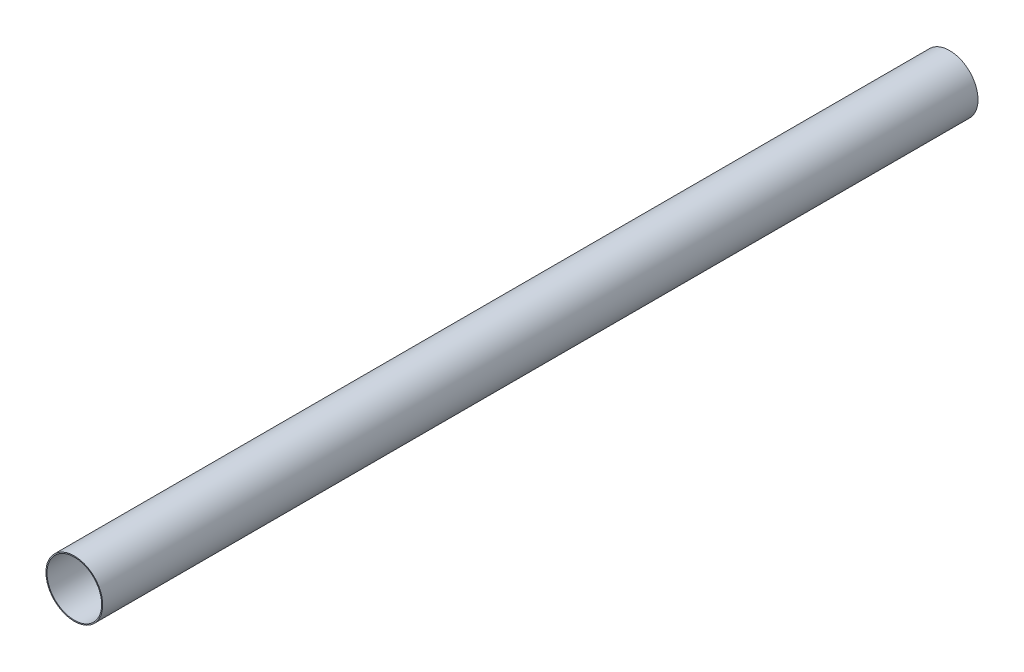
ISO-10303-21;
HEADER;
FILE_DESCRIPTION(('STEP AP214'),'2;1');
FILE_NAME('part.step','',(''),(''),'','','');
FILE_SCHEMA(('AUTOMOTIVE_DESIGN { 1 0 10303 214 1 1 1 1 }'));
ENDSEC;
DATA;
#1=APPLICATION_CONTEXT('core data for automotive mechanical design processes');
#2=APPLICATION_PROTOCOL_DEFINITION('international standard','automotive_design',2000,#1);
#3=PRODUCT_CONTEXT('',#1,'mechanical');
#4=PRODUCT('Part','Part','',(#3));
#5=PRODUCT_RELATED_PRODUCT_CATEGORY('part','',(#4));
#6=PRODUCT_DEFINITION_FORMATION('','',#4);
#7=PRODUCT_DEFINITION_CONTEXT('part definition',#1,'design');
#8=PRODUCT_DEFINITION('design','',#6,#7);
#9=PRODUCT_DEFINITION_SHAPE('','',#8);
#10=(LENGTH_UNIT() NAMED_UNIT(*) SI_UNIT(.MILLI.,.METRE.));
#11=(NAMED_UNIT(*) PLANE_ANGLE_UNIT() SI_UNIT($,.RADIAN.));
#12=(NAMED_UNIT(*) SI_UNIT($,.STERADIAN.) SOLID_ANGLE_UNIT());
#13=UNCERTAINTY_MEASURE_WITH_UNIT(LENGTH_MEASURE(1.E-05),#10,'distance_accuracy_value','');
#14=(GEOMETRIC_REPRESENTATION_CONTEXT(3) GLOBAL_UNCERTAINTY_ASSIGNED_CONTEXT((#13)) GLOBAL_UNIT_ASSIGNED_CONTEXT((#10,
#11,#12)) REPRESENTATION_CONTEXT('',''));
#15=CARTESIAN_POINT('',(0.,0.,0.));
#16=DIRECTION('',(0.,0.,1.));
#17=DIRECTION('',(1.,0.,0.));
#18=AXIS2_PLACEMENT_3D('',#15,#16,#17);
#19=CARTESIAN_POINT('',(0.,0.,5486.4));
#20=DIRECTION('',(0.,0.,1.));
#21=DIRECTION('',(1.,0.,0.));
#22=AXIS2_PLACEMENT_3D('',#19,#20,#21);
#23=PLANE('',#22);
#24=CARTESIAN_POINT('',(0.,0.,5486.4));
#25=DIRECTION('',(0.,0.,1.));
#26=DIRECTION('',(1.,0.,0.));
#27=AXIS2_PLACEMENT_3D('',#24,#25,#26);
#28=CIRCLE('',#27,177.8);
#29=CARTESIAN_POINT('',(177.8,0.,5486.4));
#30=VERTEX_POINT('',#29);
#31=EDGE_CURVE('E10',#30,#30,#28,.T.);
#32=ORIENTED_EDGE('',*,*,#31,.T.);
#33=EDGE_LOOP('',(#32));
#34=FACE_BOUND('',#33,.T.);
#35=CARTESIAN_POINT('',(0.,0.,5486.4));
#36=DIRECTION('',(0.,0.,1.));
#37=DIRECTION('',(1.,0.,0.));
#38=AXIS2_PLACEMENT_3D('',#35,#36,#37);
#39=CIRCLE('',#38,171.45);
#40=CARTESIAN_POINT('',(171.45,0.,5486.4));
#41=VERTEX_POINT('',#40);
#42=EDGE_CURVE('E39',#41,#41,#39,.T.);
#43=ORIENTED_EDGE('',*,*,#42,.F.);
#44=EDGE_LOOP('',(#43));
#45=FACE_BOUND('',#44,.T.);
#46=ADVANCED_FACE('F28',(#34,#45),#23,.T.);
#47=CARTESIAN_POINT('',(0.,0.,0.));
#48=DIRECTION('',(0.,0.,1.));
#49=DIRECTION('',(1.,0.,0.));
#50=AXIS2_PLACEMENT_3D('',#47,#48,#49);
#51=PLANE('',#50);
#52=CARTESIAN_POINT('',(0.,0.,0.));
#53=DIRECTION('',(0.,0.,1.));
#54=DIRECTION('',(1.,0.,0.));
#55=AXIS2_PLACEMENT_3D('',#52,#53,#54);
#56=CIRCLE('',#55,177.8);
#57=CARTESIAN_POINT('',(177.8,0.,0.));
#58=VERTEX_POINT('',#57);
#59=EDGE_CURVE('E32',#58,#58,#56,.T.);
#60=ORIENTED_EDGE('',*,*,#59,.F.);
#61=EDGE_LOOP('',(#60));
#62=FACE_BOUND('',#61,.T.);
#63=CARTESIAN_POINT('',(0.,0.,0.));
#64=DIRECTION('',(0.,0.,1.));
#65=DIRECTION('',(1.,0.,0.));
#66=AXIS2_PLACEMENT_3D('',#63,#64,#65);
#67=CIRCLE('',#66,171.45);
#68=CARTESIAN_POINT('',(171.45,0.,0.));
#69=VERTEX_POINT('',#68);
#70=EDGE_CURVE('E41',#69,#69,#67,.T.);
#71=ORIENTED_EDGE('',*,*,#70,.T.);
#72=EDGE_LOOP('',(#71));
#73=FACE_BOUND('',#72,.T.);
#74=ADVANCED_FACE('F51',(#62,#73),#51,.F.);
#75=CARTESIAN_POINT('',(0.,0.,5486.4));
#76=DIRECTION('',(0.,0.,-1.));
#77=DIRECTION('',(-1.,0.,0.));
#78=AXIS2_PLACEMENT_3D('',#75,#76,#77);
#79=CYLINDRICAL_SURFACE('',#78,177.8);
#80=ORIENTED_EDGE('',*,*,#31,.F.);
#81=EDGE_LOOP('',(#80));
#82=FACE_BOUND('',#81,.T.);
#83=ORIENTED_EDGE('',*,*,#59,.T.);
#84=EDGE_LOOP('',(#83));
#85=FACE_BOUND('',#84,.T.);
#86=ADVANCED_FACE('F30',(#82,#85),#79,.T.);
#87=CARTESIAN_POINT('',(0.,0.,5486.4));
#88=DIRECTION('',(0.,0.,-1.));
#89=DIRECTION('',(-1.,0.,0.));
#90=AXIS2_PLACEMENT_3D('',#87,#88,#89);
#91=CYLINDRICAL_SURFACE('',#90,171.45);
#92=ORIENTED_EDGE('',*,*,#42,.T.);
#93=EDGE_LOOP('',(#92));
#94=FACE_BOUND('',#93,.T.);
#95=ORIENTED_EDGE('',*,*,#70,.F.);
#96=EDGE_LOOP('',(#95));
#97=FACE_BOUND('',#96,.T.);
#98=ADVANCED_FACE('F47',(#94,#97),#91,.F.);
#99=CLOSED_SHELL('',(#46,#74,#86,#98));
#100=MANIFOLD_SOLID_BREP('B2',#99);
#101=ADVANCED_BREP_SHAPE_REPRESENTATION('',(#18,#100),#14);
#102=SHAPE_DEFINITION_REPRESENTATION(#9,#101);
ENDSEC;
END-ISO-10303-21;
